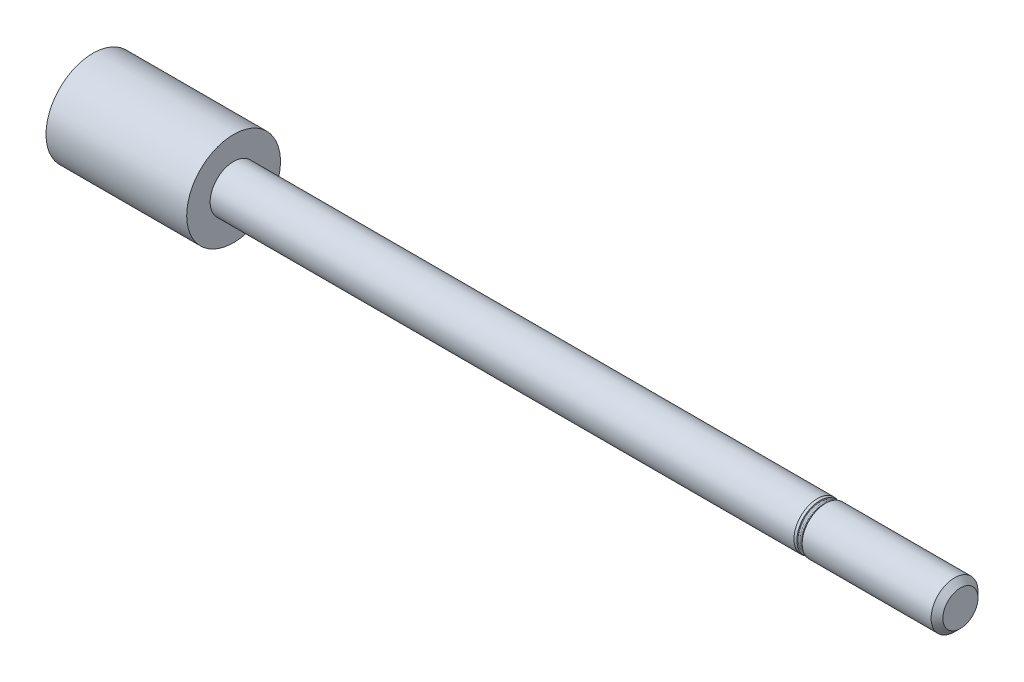
ISO-10303-21;
HEADER;
FILE_DESCRIPTION(('STEP AP214'),'2;1');
FILE_NAME('part.step','',(''),(''),'','','');
FILE_SCHEMA(('AUTOMOTIVE_DESIGN { 1 0 10303 214 1 1 1 1 }'));
ENDSEC;
DATA;
#1=APPLICATION_CONTEXT('core data for automotive mechanical design processes');
#2=APPLICATION_PROTOCOL_DEFINITION('international standard','automotive_design',2000,#1);
#3=PRODUCT_CONTEXT('',#1,'mechanical');
#4=PRODUCT('Part','Part','',(#3));
#5=PRODUCT_RELATED_PRODUCT_CATEGORY('part','',(#4));
#6=PRODUCT_DEFINITION_FORMATION('','',#4);
#7=PRODUCT_DEFINITION_CONTEXT('part definition',#1,'design');
#8=PRODUCT_DEFINITION('design','',#6,#7);
#9=PRODUCT_DEFINITION_SHAPE('','',#8);
#10=(LENGTH_UNIT() NAMED_UNIT(*) SI_UNIT(.MILLI.,.METRE.));
#11=(NAMED_UNIT(*) PLANE_ANGLE_UNIT() SI_UNIT($,.RADIAN.));
#12=(NAMED_UNIT(*) SI_UNIT($,.STERADIAN.) SOLID_ANGLE_UNIT());
#13=UNCERTAINTY_MEASURE_WITH_UNIT(LENGTH_MEASURE(1.E-05),#10,'distance_accuracy_value','');
#14=(GEOMETRIC_REPRESENTATION_CONTEXT(3) GLOBAL_UNCERTAINTY_ASSIGNED_CONTEXT((#13)) GLOBAL_UNIT_ASSIGNED_CONTEXT((#10,
#11,#12)) REPRESENTATION_CONTEXT('',''));
#15=CARTESIAN_POINT('',(0.,0.,0.));
#16=DIRECTION('',(0.,0.,1.));
#17=DIRECTION('',(1.,0.,0.));
#18=AXIS2_PLACEMENT_3D('',#15,#16,#17);
#19=CARTESIAN_POINT('',(32.,1.5,0.));
#20=DIRECTION('',(1.,0.,0.));
#21=DIRECTION('',(0.,0.,-1.));
#22=AXIS2_PLACEMENT_3D('',#19,#20,#21);
#23=PLANE('',#22);
#24=CARTESIAN_POINT('',(32.,0.,0.));
#25=DIRECTION('',(-1.,0.,0.));
#26=DIRECTION('',(0.,0.,1.));
#27=AXIS2_PLACEMENT_3D('',#24,#25,#26);
#28=CIRCLE('',#27,1.5);
#29=CARTESIAN_POINT('',(32.,0.,1.5));
#30=VERTEX_POINT('',#29);
#31=EDGE_CURVE('E10',#30,#30,#28,.T.);
#32=ORIENTED_EDGE('',*,*,#31,.F.);
#33=EDGE_LOOP('',(#32));
#34=FACE_BOUND('',#33,.T.);
#35=ADVANCED_FACE('F35',(#34),#23,.T.);
#36=CARTESIAN_POINT('',(31.5,0.,0.));
#37=DIRECTION('',(-1.,0.,0.));
#38=DIRECTION('',(0.,0.,1.));
#39=AXIS2_PLACEMENT_3D('',#36,#37,#38);
#40=CONICAL_SURFACE('',#39,2.,0.785398163397446);
#41=ORIENTED_EDGE('',*,*,#31,.T.);
#42=EDGE_LOOP('',(#41));
#43=FACE_BOUND('',#42,.T.);
#44=CARTESIAN_POINT('',(31.5,0.,0.));
#45=DIRECTION('',(-1.,0.,0.));
#46=DIRECTION('',(0.,0.,1.));
#47=AXIS2_PLACEMENT_3D('',#44,#45,#46);
#48=CIRCLE('',#47,2.);
#49=CARTESIAN_POINT('',(31.5,0.,2.));
#50=VERTEX_POINT('',#49);
#51=EDGE_CURVE('E41',#50,#50,#48,.T.);
#52=ORIENTED_EDGE('',*,*,#51,.F.);
#53=EDGE_LOOP('',(#52));
#54=FACE_BOUND('',#53,.T.);
#55=ADVANCED_FACE('F95',(#43,#54),#40,.T.);
#56=CARTESIAN_POINT('',(0.,0.,0.));
#57=DIRECTION('',(-1.,0.,0.));
#58=DIRECTION('',(0.,0.,1.));
#59=AXIS2_PLACEMENT_3D('',#56,#57,#58);
#60=CYLINDRICAL_SURFACE('',#59,2.);
#61=ORIENTED_EDGE('',*,*,#51,.T.);
#62=EDGE_LOOP('',(#61));
#63=FACE_BOUND('',#62,.T.);
#64=CARTESIAN_POINT('',(20.5,0.,0.));
#65=DIRECTION('',(-1.,0.,0.));
#66=DIRECTION('',(0.,0.,1.));
#67=AXIS2_PLACEMENT_3D('',#64,#65,#66);
#68=CIRCLE('',#67,2.);
#69=CARTESIAN_POINT('',(20.5,0.,2.));
#70=VERTEX_POINT('',#69);
#71=EDGE_CURVE('E45',#70,#70,#68,.T.);
#72=ORIENTED_EDGE('',*,*,#71,.F.);
#73=EDGE_LOOP('',(#72));
#74=FACE_BOUND('',#73,.T.);
#75=ADVANCED_FACE('F100',(#63,#74),#60,.T.);
#76=CARTESIAN_POINT('',(20.2792893218813,0.,0.));
#77=DIRECTION('',(1.,0.,0.));
#78=DIRECTION('',(0.,0.,-1.));
#79=AXIS2_PLACEMENT_3D('',#76,#77,#78);
#80=CONICAL_SURFACE('',#79,1.77928932188135,0.785398163397449);
#81=ORIENTED_EDGE('',*,*,#71,.T.);
#82=EDGE_LOOP('',(#81));
#83=FACE_BOUND('',#82,.T.);
#84=CARTESIAN_POINT('',(20.2792893218813,0.,0.));
#85=DIRECTION('',(-1.,0.,0.));
#86=DIRECTION('',(0.,0.,1.));
#87=AXIS2_PLACEMENT_3D('',#84,#85,#86);
#88=CIRCLE('',#87,1.77928932188135);
#89=CARTESIAN_POINT('',(20.2792893218813,0.,1.77928932188135));
#90=VERTEX_POINT('',#89);
#91=EDGE_CURVE('E49',#90,#90,#88,.T.);
#92=ORIENTED_EDGE('',*,*,#91,.F.);
#93=EDGE_LOOP('',(#92));
#94=FACE_BOUND('',#93,.T.);
#95=ADVANCED_FACE('F104',(#83,#94),#80,.T.);
#96=CARTESIAN_POINT('',(20.2085786437627,0.,0.));
#97=DIRECTION('',(-1.,0.,0.));
#98=DIRECTION('',(0.,0.,1.));
#99=AXIS2_PLACEMENT_3D('',#96,#97,#98);
#100=TOROIDAL_SURFACE('',#99,1.85,0.100000000000001);
#101=ORIENTED_EDGE('',*,*,#91,.T.);
#102=EDGE_LOOP('',(#101));
#103=FACE_BOUND('',#102,.T.);
#104=CARTESIAN_POINT('',(20.2085786437627,0.,0.));
#105=DIRECTION('',(-1.,0.,0.));
#106=DIRECTION('',(0.,0.,1.));
#107=AXIS2_PLACEMENT_3D('',#104,#105,#106);
#108=CIRCLE('',#107,1.75);
#109=CARTESIAN_POINT('',(20.2085786437627,0.,1.75));
#110=VERTEX_POINT('',#109);
#111=EDGE_CURVE('E54',#110,#110,#108,.T.);
#112=ORIENTED_EDGE('',*,*,#111,.F.);
#113=EDGE_LOOP('',(#112));
#114=FACE_BOUND('',#113,.T.);
#115=ADVANCED_FACE('F110',(#103,#114),#100,.F.);
#116=CARTESIAN_POINT('',(0.,0.,0.));
#117=DIRECTION('',(-1.,0.,0.));
#118=DIRECTION('',(0.,0.,1.));
#119=AXIS2_PLACEMENT_3D('',#116,#117,#118);
#120=CYLINDRICAL_SURFACE('',#119,1.75);
#121=ORIENTED_EDGE('',*,*,#111,.T.);
#122=EDGE_LOOP('',(#121));
#123=FACE_BOUND('',#122,.T.);
#124=CARTESIAN_POINT('',(20.1,0.,0.));
#125=DIRECTION('',(-1.,0.,0.));
#126=DIRECTION('',(0.,0.,1.));
#127=AXIS2_PLACEMENT_3D('',#124,#125,#126);
#128=CIRCLE('',#127,1.75);
#129=CARTESIAN_POINT('',(20.1,0.,1.75));
#130=VERTEX_POINT('',#129);
#131=EDGE_CURVE('E57',#130,#130,#128,.T.);
#132=ORIENTED_EDGE('',*,*,#131,.F.);
#133=EDGE_LOOP('',(#132));
#134=FACE_BOUND('',#133,.T.);
#135=ADVANCED_FACE('F114',(#123,#134),#120,.T.);
#136=CARTESIAN_POINT('',(20.1,0.,0.));
#137=DIRECTION('',(-1.,0.,0.));
#138=DIRECTION('',(0.,0.,1.));
#139=AXIS2_PLACEMENT_3D('',#136,#137,#138);
#140=TOROIDAL_SURFACE('',#139,1.85,0.0999999999999979);
#141=ORIENTED_EDGE('',*,*,#131,.T.);
#142=EDGE_LOOP('',(#141));
#143=FACE_BOUND('',#142,.T.);
#144=CARTESIAN_POINT('',(20.,0.,0.));
#145=DIRECTION('',(-1.,0.,0.));
#146=DIRECTION('',(0.,0.,1.));
#147=AXIS2_PLACEMENT_3D('',#144,#145,#146);
#148=CIRCLE('',#147,1.85);
#149=CARTESIAN_POINT('',(20.,0.,1.85));
#150=VERTEX_POINT('',#149);
#151=EDGE_CURVE('E60',#150,#150,#148,.T.);
#152=ORIENTED_EDGE('',*,*,#151,.F.);
#153=EDGE_LOOP('',(#152));
#154=FACE_BOUND('',#153,.T.);
#155=ADVANCED_FACE('F118',(#143,#154),#140,.F.);
#156=CARTESIAN_POINT('',(20.,1.94641016151378,0.));
#157=DIRECTION('',(1.,0.,0.));
#158=DIRECTION('',(0.,0.,-1.));
#159=AXIS2_PLACEMENT_3D('',#156,#157,#158);
#160=PLANE('',#159);
#161=ORIENTED_EDGE('',*,*,#151,.T.);
#162=EDGE_LOOP('',(#161));
#163=FACE_BOUND('',#162,.T.);
#164=CARTESIAN_POINT('',(20.,0.,0.));
#165=DIRECTION('',(-1.,0.,0.));
#166=DIRECTION('',(0.,0.,1.));
#167=AXIS2_PLACEMENT_3D('',#164,#165,#166);
#168=CIRCLE('',#167,1.94641016151378);
#169=CARTESIAN_POINT('',(20.,0.,1.94641016151378));
#170=VERTEX_POINT('',#169);
#171=EDGE_CURVE('E63',#170,#170,#168,.T.);
#172=ORIENTED_EDGE('',*,*,#171,.F.);
#173=EDGE_LOOP('',(#172));
#174=FACE_BOUND('',#173,.T.);
#175=ADVANCED_FACE('F122',(#163,#174),#160,.T.);
#176=CARTESIAN_POINT('',(19.8,0.,0.));
#177=DIRECTION('',(-1.,0.,0.));
#178=DIRECTION('',(0.,0.,1.));
#179=AXIS2_PLACEMENT_3D('',#176,#177,#178);
#180=CONICAL_SURFACE('',#179,2.,0.26179938779915);
#181=ORIENTED_EDGE('',*,*,#171,.T.);
#182=EDGE_LOOP('',(#181));
#183=FACE_BOUND('',#182,.T.);
#184=CARTESIAN_POINT('',(19.8,0.,0.));
#185=DIRECTION('',(-1.,0.,0.));
#186=DIRECTION('',(0.,0.,1.));
#187=AXIS2_PLACEMENT_3D('',#184,#185,#186);
#188=CIRCLE('',#187,2.);
#189=CARTESIAN_POINT('',(19.8,0.,2.));
#190=VERTEX_POINT('',#189);
#191=EDGE_CURVE('E66',#190,#190,#188,.T.);
#192=ORIENTED_EDGE('',*,*,#191,.F.);
#193=EDGE_LOOP('',(#192));
#194=FACE_BOUND('',#193,.T.);
#195=ADVANCED_FACE('F126',(#183,#194),#180,.T.);
#196=CARTESIAN_POINT('',(0.,0.,0.));
#197=DIRECTION('',(-1.,0.,0.));
#198=DIRECTION('',(0.,0.,1.));
#199=AXIS2_PLACEMENT_3D('',#196,#197,#198);
#200=CYLINDRICAL_SURFACE('',#199,2.);
#201=ORIENTED_EDGE('',*,*,#191,.T.);
#202=EDGE_LOOP('',(#201));
#203=FACE_BOUND('',#202,.T.);
#204=CARTESIAN_POINT('',(-30.,0.,0.));
#205=DIRECTION('',(-1.,0.,0.));
#206=DIRECTION('',(0.,0.,1.));
#207=AXIS2_PLACEMENT_3D('',#204,#205,#206);
#208=CIRCLE('',#207,2.);
#209=CARTESIAN_POINT('',(-30.,0.,2.));
#210=VERTEX_POINT('',#209);
#211=EDGE_CURVE('E69',#210,#210,#208,.T.);
#212=ORIENTED_EDGE('',*,*,#211,.F.);
#213=EDGE_LOOP('',(#212));
#214=FACE_BOUND('',#213,.T.);
#215=ADVANCED_FACE('F91',(#203,#214),#200,.T.);
#216=CARTESIAN_POINT('',(-30.,2.,0.));
#217=DIRECTION('',(-1.,0.,0.));
#218=DIRECTION('',(0.,0.,1.));
#219=AXIS2_PLACEMENT_3D('',#216,#217,#218);
#220=PLANE('',#219);
#221=CARTESIAN_POINT('',(-30.,0.,0.));
#222=DIRECTION('',(-1.,0.,0.));
#223=DIRECTION('',(0.,0.,1.));
#224=AXIS2_PLACEMENT_3D('',#221,#222,#223);
#225=CIRCLE('',#224,4.);
#226=CARTESIAN_POINT('',(-30.,0.,4.));
#227=VERTEX_POINT('',#226);
#228=EDGE_CURVE('E72',#227,#227,#225,.T.);
#229=ORIENTED_EDGE('',*,*,#228,.F.);
#230=EDGE_LOOP('',(#229));
#231=FACE_BOUND('',#230,.T.);
#232=ORIENTED_EDGE('',*,*,#211,.T.);
#233=EDGE_LOOP('',(#232));
#234=FACE_BOUND('',#233,.T.);
#235=ADVANCED_FACE('F83',(#231,#234),#220,.F.);
#236=CARTESIAN_POINT('',(0.,0.,0.));
#237=DIRECTION('',(-1.,0.,0.));
#238=DIRECTION('',(0.,0.,1.));
#239=AXIS2_PLACEMENT_3D('',#236,#237,#238);
#240=CYLINDRICAL_SURFACE('',#239,4.);
#241=ORIENTED_EDGE('',*,*,#228,.T.);
#242=EDGE_LOOP('',(#241));
#243=FACE_BOUND('',#242,.T.);
#244=CARTESIAN_POINT('',(-42.,0.,0.));
#245=DIRECTION('',(-1.,0.,0.));
#246=DIRECTION('',(0.,0.,1.));
#247=AXIS2_PLACEMENT_3D('',#244,#245,#246);
#248=CIRCLE('',#247,4.);
#249=CARTESIAN_POINT('',(-42.,0.,4.));
#250=VERTEX_POINT('',#249);
#251=EDGE_CURVE('E75',#250,#250,#248,.T.);
#252=ORIENTED_EDGE('',*,*,#251,.F.);
#253=EDGE_LOOP('',(#252));
#254=FACE_BOUND('',#253,.T.);
#255=ADVANCED_FACE('F81',(#243,#254),#240,.T.);
#256=CARTESIAN_POINT('',(-42.,0.,0.));
#257=DIRECTION('',(-1.,0.,0.));
#258=DIRECTION('',(0.,0.,1.));
#259=AXIS2_PLACEMENT_3D('',#256,#257,#258);
#260=PLANE('',#259);
#261=ORIENTED_EDGE('',*,*,#251,.T.);
#262=EDGE_LOOP('',(#261));
#263=FACE_BOUND('',#262,.T.);
#264=ADVANCED_FACE('F79',(#263),#260,.T.);
#265=CLOSED_SHELL('',(#35,#55,#75,#95,#115,#135,#155,#175,#195,#215,#235,#255,#264));
#266=MANIFOLD_SOLID_BREP('B2',#265);
#267=ADVANCED_BREP_SHAPE_REPRESENTATION('',(#18,#266),#14);
#268=SHAPE_DEFINITION_REPRESENTATION(#9,#267);
ENDSEC;
END-ISO-10303-21;
